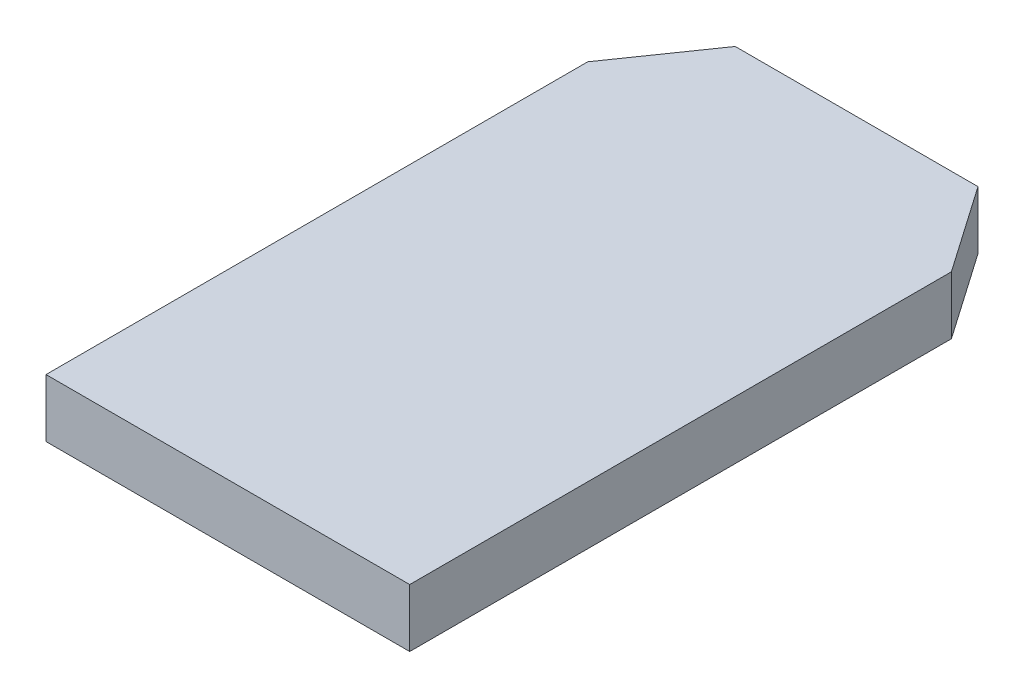
ISO-10303-21;
HEADER;
FILE_DESCRIPTION(('STEP AP214'),'2;1');
FILE_NAME('part.step','',(''),(''),'','','');
FILE_SCHEMA(('AUTOMOTIVE_DESIGN { 1 0 10303 214 1 1 1 1 }'));
ENDSEC;
DATA;
#1=APPLICATION_CONTEXT('core data for automotive mechanical design processes');
#2=APPLICATION_PROTOCOL_DEFINITION('international standard','automotive_design',2000,#1);
#3=PRODUCT_CONTEXT('',#1,'mechanical');
#4=PRODUCT('Part','Part','',(#3));
#5=PRODUCT_RELATED_PRODUCT_CATEGORY('part','',(#4));
#6=PRODUCT_DEFINITION_FORMATION('','',#4);
#7=PRODUCT_DEFINITION_CONTEXT('part definition',#1,'design');
#8=PRODUCT_DEFINITION('design','',#6,#7);
#9=PRODUCT_DEFINITION_SHAPE('','',#8);
#10=(LENGTH_UNIT() NAMED_UNIT(*) SI_UNIT(.MILLI.,.METRE.));
#11=(NAMED_UNIT(*) PLANE_ANGLE_UNIT() SI_UNIT($,.RADIAN.));
#12=(NAMED_UNIT(*) SI_UNIT($,.STERADIAN.) SOLID_ANGLE_UNIT());
#13=UNCERTAINTY_MEASURE_WITH_UNIT(LENGTH_MEASURE(1.E-05),#10,'distance_accuracy_value','');
#14=(GEOMETRIC_REPRESENTATION_CONTEXT(3) GLOBAL_UNCERTAINTY_ASSIGNED_CONTEXT((#13)) GLOBAL_UNIT_ASSIGNED_CONTEXT((#10,
#11,#12)) REPRESENTATION_CONTEXT('',''));
#15=CARTESIAN_POINT('',(0.,0.,0.));
#16=DIRECTION('',(0.,0.,1.));
#17=DIRECTION('',(1.,0.,0.));
#18=AXIS2_PLACEMENT_3D('',#15,#16,#17);
#19=CARTESIAN_POINT('',(2.85114999999982,11.2458500000004,-12.8778000000013));
#20=DIRECTION('',(0.,-1.,0.));
#21=DIRECTION('',(1.,0.,0.));
#22=AXIS2_PLACEMENT_3D('',#19,#20,#21);
#23=PLANE('',#22);
#24=DIRECTION('',(-0.570395809495344,0.,0.821369965673296));
#25=VECTOR('',#24,1.);
#26=CARTESIAN_POINT('',(3.24802499999981,11.2458500000004,-20.5613000000012));
#27=LINE('',#26,#25);
#28=CARTESIAN_POINT('',(3.64489999999982,11.2458500000004,-21.1328000000012));
#29=VERTEX_POINT('',#28);
#30=CARTESIAN_POINT('',(2.85114999999982,11.2458500000004,-19.9898000000012));
#31=VERTEX_POINT('',#30);
#32=EDGE_CURVE('E67',#29,#31,#27,.T.);
#33=ORIENTED_EDGE('',*,*,#32,.F.);
#34=DIRECTION('',(1.,0.,0.));
#35=VECTOR('',#34,1.);
#36=CARTESIAN_POINT('',(5.23874999999981,11.2458500000004,-21.1328000000013));
#37=LINE('',#36,#35);
#38=CARTESIAN_POINT('',(6.83259999999984,11.2458500000004,-21.1328000000013));
#39=VERTEX_POINT('',#38);
#40=EDGE_CURVE('E69',#29,#39,#37,.T.);
#41=ORIENTED_EDGE('',*,*,#40,.T.);
#42=DIRECTION('',(-0.570395809495344,0.,-0.821369965673296));
#43=VECTOR('',#42,1.);
#44=CARTESIAN_POINT('',(7.22947499999981,11.2458500000004,-20.5613000000013));
#45=LINE('',#44,#43);
#46=CARTESIAN_POINT('',(7.62634999999982,11.2458500000004,-19.9898000000013));
#47=VERTEX_POINT('',#46);
#48=EDGE_CURVE('E20',#47,#39,#45,.T.);
#49=ORIENTED_EDGE('',*,*,#48,.F.);
#50=DIRECTION('',(0.,0.,-1.));
#51=VECTOR('',#50,1.);
#52=CARTESIAN_POINT('',(7.62634999999982,11.2458500000004,-12.8778000000013));
#53=LINE('',#52,#51);
#54=CARTESIAN_POINT('',(7.62634999999982,11.2458500000004,-12.8778000000019));
#55=VERTEX_POINT('',#54);
#56=EDGE_CURVE('E104',#55,#47,#53,.T.);
#57=ORIENTED_EDGE('',*,*,#56,.F.);
#58=DIRECTION('',(-1.,0.,0.));
#59=VECTOR('',#58,1.);
#60=CARTESIAN_POINT('',(-3.01980662698043E-13,11.2458500000004,-12.8778000000025));
#61=LINE('',#60,#59);
#62=CARTESIAN_POINT('',(2.85114999999982,11.2458500000004,-12.8778000000016));
#63=VERTEX_POINT('',#62);
#64=EDGE_CURVE('E98',#55,#63,#61,.T.);
#65=ORIENTED_EDGE('',*,*,#64,.T.);
#66=DIRECTION('',(0.,0.,1.));
#67=VECTOR('',#66,1.);
#68=CARTESIAN_POINT('',(2.85114999999982,11.2458500000004,-12.8778000000013));
#69=LINE('',#68,#67);
#70=EDGE_CURVE('E95',#31,#63,#69,.T.);
#71=ORIENTED_EDGE('',*,*,#70,.F.);
#72=EDGE_LOOP('',(#33,#41,#49,#57,#65,#71));
#73=FACE_BOUND('',#72,.T.);
#74=ADVANCED_FACE('F17',(#73),#23,.T.);
#75=CARTESIAN_POINT('',(7.22947499999981,11.4363500000004,-20.5613000000013));
#76=DIRECTION('',(0.821369965673296,0.,-0.570395809495344));
#77=DIRECTION('',(-0.570395809495344,0.,-0.821369965673296));
#78=AXIS2_PLACEMENT_3D('',#75,#76,#77);
#79=PLANE('',#78);
#80=ORIENTED_EDGE('',*,*,#48,.T.);
#81=DIRECTION('',(0.,1.,0.));
#82=VECTOR('',#81,1.);
#83=CARTESIAN_POINT('',(6.83259999999981,11.6268500000004,-21.1328000000013));
#84=LINE('',#83,#82);
#85=CARTESIAN_POINT('',(6.83259999999981,12.0078500000004,-21.1328000000013));
#86=VERTEX_POINT('',#85);
#87=EDGE_CURVE('E76',#39,#86,#84,.T.);
#88=ORIENTED_EDGE('',*,*,#87,.T.);
#89=DIRECTION('',(-0.570395809495339,0.,-0.821369965673299));
#90=VECTOR('',#89,1.);
#91=CARTESIAN_POINT('',(7.62634999999982,12.0078500000004,-19.9898000000013));
#92=LINE('',#91,#90);
#93=CARTESIAN_POINT('',(7.62634999999982,12.0078500000004,-19.9898000000013));
#94=VERTEX_POINT('',#93);
#95=EDGE_CURVE('E106',#94,#86,#92,.T.);
#96=ORIENTED_EDGE('',*,*,#95,.F.);
#97=DIRECTION('',(0.,1.,0.));
#98=VECTOR('',#97,1.);
#99=CARTESIAN_POINT('',(7.62634999999982,11.2458500000004,-19.9898000000013));
#100=LINE('',#99,#98);
#101=EDGE_CURVE('E81',#47,#94,#100,.T.);
#102=ORIENTED_EDGE('',*,*,#101,.F.);
#103=EDGE_LOOP('',(#80,#88,#96,#102));
#104=FACE_BOUND('',#103,.T.);
#105=ADVANCED_FACE('F78',(#104),#79,.T.);
#106=CARTESIAN_POINT('',(5.23874999999981,11.6268500000004,-21.1328000000013));
#107=DIRECTION('',(0.,0.,1.));
#108=DIRECTION('',(1.,0.,0.));
#109=AXIS2_PLACEMENT_3D('',#106,#107,#108);
#110=PLANE('',#109);
#111=ORIENTED_EDGE('',*,*,#40,.F.);
#112=DIRECTION('',(0.,1.,0.));
#113=VECTOR('',#112,1.);
#114=CARTESIAN_POINT('',(3.64489999999986,11.8173500000004,-21.1328000000013));
#115=LINE('',#114,#113);
#116=CARTESIAN_POINT('',(3.64489999999983,12.0078500000004,-21.1328000000013));
#117=VERTEX_POINT('',#116);
#118=EDGE_CURVE('E88',#117,#29,#115,.F.);
#119=ORIENTED_EDGE('',*,*,#118,.F.);
#120=DIRECTION('',(-1.,0.,0.));
#121=VECTOR('',#120,1.);
#122=CARTESIAN_POINT('',(7.62634999999982,12.0078500000004,-21.1328000000013));
#123=LINE('',#122,#121);
#124=EDGE_CURVE('E85',#86,#117,#123,.T.);
#125=ORIENTED_EDGE('',*,*,#124,.F.);
#126=ORIENTED_EDGE('',*,*,#87,.F.);
#127=EDGE_LOOP('',(#111,#119,#125,#126));
#128=FACE_BOUND('',#127,.T.);
#129=ADVANCED_FACE('F83',(#128),#110,.F.);
#130=CARTESIAN_POINT('',(3.24802499999981,11.8173500000004,-20.5613000000012));
#131=DIRECTION('',(-0.821369965673296,0.,-0.570395809495344));
#132=DIRECTION('',(-0.570395809495344,0.,0.821369965673296));
#133=AXIS2_PLACEMENT_3D('',#130,#131,#132);
#134=PLANE('',#133);
#135=DIRECTION('',(-0.570395809495344,0.,0.821369965673296));
#136=VECTOR('',#135,1.);
#137=CARTESIAN_POINT('',(3.64489999999982,12.0078500000004,-21.1328000000013));
#138=LINE('',#137,#136);
#139=CARTESIAN_POINT('',(2.85114999999982,12.0078500000004,-19.9898000000012));
#140=VERTEX_POINT('',#139);
#141=EDGE_CURVE('E109',#117,#140,#138,.T.);
#142=ORIENTED_EDGE('',*,*,#141,.F.);
#143=ORIENTED_EDGE('',*,*,#118,.T.);
#144=ORIENTED_EDGE('',*,*,#32,.T.);
#145=DIRECTION('',(0.,1.,0.));
#146=VECTOR('',#145,1.);
#147=CARTESIAN_POINT('',(2.85114999999982,12.0078500000004,-19.9898000000013));
#148=LINE('',#147,#146);
#149=EDGE_CURVE('E92',#140,#31,#148,.F.);
#150=ORIENTED_EDGE('',*,*,#149,.F.);
#151=EDGE_LOOP('',(#142,#143,#144,#150));
#152=FACE_BOUND('',#151,.T.);
#153=ADVANCED_FACE('F137',(#152),#134,.T.);
#154=CARTESIAN_POINT('',(2.85114999999982,12.0078500000004,-12.8778000000013));
#155=DIRECTION('',(-1.,0.,0.));
#156=DIRECTION('',(0.,0.,1.));
#157=AXIS2_PLACEMENT_3D('',#154,#155,#156);
#158=PLANE('',#157);
#159=DIRECTION('',(0.,1.,0.));
#160=VECTOR('',#159,1.);
#161=CARTESIAN_POINT('',(2.85114999999982,15.1130000000006,-12.8778000000025));
#162=LINE('',#161,#160);
#163=CARTESIAN_POINT('',(2.85114999999982,12.0078500000004,-12.8778000000016));
#164=VERTEX_POINT('',#163);
#165=EDGE_CURVE('E100',#63,#164,#162,.T.);
#166=ORIENTED_EDGE('',*,*,#165,.T.);
#167=DIRECTION('',(0.,0.,1.));
#168=VECTOR('',#167,1.);
#169=CARTESIAN_POINT('',(2.85114999999982,12.0078500000004,-12.8778000000013));
#170=LINE('',#169,#168);
#171=EDGE_CURVE('E112',#140,#164,#170,.T.);
#172=ORIENTED_EDGE('',*,*,#171,.F.);
#173=ORIENTED_EDGE('',*,*,#149,.T.);
#174=ORIENTED_EDGE('',*,*,#70,.T.);
#175=EDGE_LOOP('',(#166,#172,#173,#174));
#176=FACE_BOUND('',#175,.T.);
#177=ADVANCED_FACE('F122',(#176),#158,.T.);
#178=CARTESIAN_POINT('',(-3.01980662698043E-13,15.1130000000006,-12.8778000000025));
#179=DIRECTION('',(0.,0.,-1.));
#180=DIRECTION('',(-1.,0.,0.));
#181=AXIS2_PLACEMENT_3D('',#178,#179,#180);
#182=PLANE('',#181);
#183=ORIENTED_EDGE('',*,*,#165,.F.);
#184=ORIENTED_EDGE('',*,*,#64,.F.);
#185=DIRECTION('',(0.,1.,0.));
#186=VECTOR('',#185,1.);
#187=CARTESIAN_POINT('',(7.62634999999982,11.2458500000004,-12.8778000000013));
#188=LINE('',#187,#186);
#189=CARTESIAN_POINT('',(7.62634999999982,12.0078500000004,-12.8778000000019));
#190=VERTEX_POINT('',#189);
#191=EDGE_CURVE('E35',#190,#55,#188,.F.);
#192=ORIENTED_EDGE('',*,*,#191,.F.);
#193=DIRECTION('',(-1.,0.,0.));
#194=VECTOR('',#193,1.);
#195=CARTESIAN_POINT('',(7.62634999999982,12.0078500000004,-12.8778000000013));
#196=LINE('',#195,#194);
#197=EDGE_CURVE('E26',#164,#190,#196,.F.);
#198=ORIENTED_EDGE('',*,*,#197,.F.);
#199=EDGE_LOOP('',(#183,#184,#192,#198));
#200=FACE_BOUND('',#199,.T.);
#201=ADVANCED_FACE('F120',(#200),#182,.F.);
#202=CARTESIAN_POINT('',(7.62634999999982,11.2458500000004,-12.8778000000013));
#203=DIRECTION('',(1.,0.,0.));
#204=DIRECTION('',(0.,0.,-1.));
#205=AXIS2_PLACEMENT_3D('',#202,#203,#204);
#206=PLANE('',#205);
#207=ORIENTED_EDGE('',*,*,#191,.T.);
#208=ORIENTED_EDGE('',*,*,#56,.T.);
#209=ORIENTED_EDGE('',*,*,#101,.T.);
#210=DIRECTION('',(0.,0.,1.));
#211=VECTOR('',#210,1.);
#212=CARTESIAN_POINT('',(7.62634999999982,12.0078500000004,-12.8778000000013));
#213=LINE('',#212,#211);
#214=EDGE_CURVE('E11',#190,#94,#213,.F.);
#215=ORIENTED_EDGE('',*,*,#214,.F.);
#216=EDGE_LOOP('',(#207,#208,#209,#215));
#217=FACE_BOUND('',#216,.T.);
#218=ADVANCED_FACE('F124',(#217),#206,.T.);
#219=CARTESIAN_POINT('',(7.62634999999982,12.0078500000004,-12.8778000000013));
#220=DIRECTION('',(0.,1.,0.));
#221=DIRECTION('',(-1.,0.,0.));
#222=AXIS2_PLACEMENT_3D('',#219,#220,#221);
#223=PLANE('',#222);
#224=ORIENTED_EDGE('',*,*,#197,.T.);
#225=ORIENTED_EDGE('',*,*,#214,.T.);
#226=ORIENTED_EDGE('',*,*,#95,.T.);
#227=ORIENTED_EDGE('',*,*,#124,.T.);
#228=ORIENTED_EDGE('',*,*,#141,.T.);
#229=ORIENTED_EDGE('',*,*,#171,.T.);
#230=EDGE_LOOP('',(#224,#225,#226,#227,#228,#229));
#231=FACE_BOUND('',#230,.T.);
#232=ADVANCED_FACE('F117',(#231),#223,.T.);
#233=CLOSED_SHELL('',(#74,#105,#129,#153,#177,#201,#218,#232));
#234=MANIFOLD_SOLID_BREP('B1',#233);
#235=ADVANCED_BREP_SHAPE_REPRESENTATION('',(#18,#234),#14);
#236=SHAPE_DEFINITION_REPRESENTATION(#9,#235);
ENDSEC;
END-ISO-10303-21;
